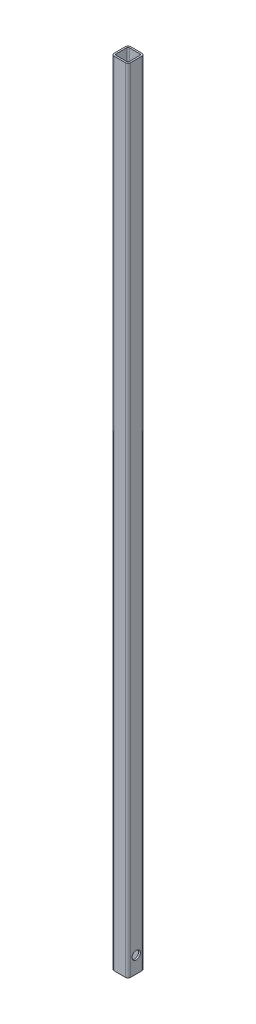
ISO-10303-21;
HEADER;
FILE_DESCRIPTION(('STEP AP214'),'2;1');
FILE_NAME('part.step','',(''),(''),'','','');
FILE_SCHEMA(('AUTOMOTIVE_DESIGN { 1 0 10303 214 1 1 1 1 }'));
ENDSEC;
DATA;
#1=APPLICATION_CONTEXT('core data for automotive mechanical design processes');
#2=APPLICATION_PROTOCOL_DEFINITION('international standard','automotive_design',2000,#1);
#3=PRODUCT_CONTEXT('',#1,'mechanical');
#4=PRODUCT('Part','Part','',(#3));
#5=PRODUCT_RELATED_PRODUCT_CATEGORY('part','',(#4));
#6=PRODUCT_DEFINITION_FORMATION('','',#4);
#7=PRODUCT_DEFINITION_CONTEXT('part definition',#1,'design');
#8=PRODUCT_DEFINITION('design','',#6,#7);
#9=PRODUCT_DEFINITION_SHAPE('','',#8);
#10=(LENGTH_UNIT() NAMED_UNIT(*) SI_UNIT(.MILLI.,.METRE.));
#11=(NAMED_UNIT(*) PLANE_ANGLE_UNIT() SI_UNIT($,.RADIAN.));
#12=(NAMED_UNIT(*) SI_UNIT($,.STERADIAN.) SOLID_ANGLE_UNIT());
#13=UNCERTAINTY_MEASURE_WITH_UNIT(LENGTH_MEASURE(1.E-05),#10,'distance_accuracy_value','');
#14=(GEOMETRIC_REPRESENTATION_CONTEXT(3) GLOBAL_UNCERTAINTY_ASSIGNED_CONTEXT((#13)) GLOBAL_UNIT_ASSIGNED_CONTEXT((#10,
#11,#12)) REPRESENTATION_CONTEXT('',''));
#15=CARTESIAN_POINT('',(0.,0.,0.));
#16=DIRECTION('',(0.,0.,1.));
#17=DIRECTION('',(1.,0.,0.));
#18=AXIS2_PLACEMENT_3D('',#15,#16,#17);
#19=CARTESIAN_POINT('',(4.,1219.2,-21.4));
#20=DIRECTION('',(0.,-1.,0.));
#21=DIRECTION('',(0.,0.,-1.));
#22=AXIS2_PLACEMENT_3D('',#19,#20,#21);
#23=PLANE('',#22);
#24=CARTESIAN_POINT('',(4.,1219.2,-21.4));
#25=DIRECTION('',(0.,1.,0.));
#26=DIRECTION('',(0.,0.,-1.));
#27=AXIS2_PLACEMENT_3D('',#24,#25,#26);
#28=CIRCLE('',#27,4.);
#29=CARTESIAN_POINT('',(4.00000000000003,1219.2,-25.4));
#30=VERTEX_POINT('',#29);
#31=CARTESIAN_POINT('',(0.,1219.2,-21.4));
#32=VERTEX_POINT('',#31);
#33=EDGE_CURVE('E213',#30,#32,#28,.T.);
#34=ORIENTED_EDGE('',*,*,#33,.T.);
#35=DIRECTION('',(0.,0.,1.));
#36=VECTOR('',#35,1.);
#37=CARTESIAN_POINT('',(0.,1219.2,-4.00000000000003));
#38=LINE('',#37,#36);
#39=CARTESIAN_POINT('',(0.,1219.2,-4.00000000000003));
#40=VERTEX_POINT('',#39);
#41=EDGE_CURVE('E216',#32,#40,#38,.T.);
#42=ORIENTED_EDGE('',*,*,#41,.T.);
#43=CARTESIAN_POINT('',(4.,1219.2,-4.));
#44=DIRECTION('',(0.,1.,0.));
#45=DIRECTION('',(0.,0.,-1.));
#46=AXIS2_PLACEMENT_3D('',#43,#44,#45);
#47=CIRCLE('',#46,4.);
#48=CARTESIAN_POINT('',(4.00000000000003,1219.2,0.));
#49=VERTEX_POINT('',#48);
#50=EDGE_CURVE('E219',#40,#49,#47,.T.);
#51=ORIENTED_EDGE('',*,*,#50,.T.);
#52=DIRECTION('',(1.,0.,0.));
#53=VECTOR('',#52,1.);
#54=CARTESIAN_POINT('',(4.00000000000003,1219.2,0.));
#55=LINE('',#54,#53);
#56=CARTESIAN_POINT('',(21.4,1219.2,0.));
#57=VERTEX_POINT('',#56);
#58=EDGE_CURVE('E221',#49,#57,#55,.T.);
#59=ORIENTED_EDGE('',*,*,#58,.T.);
#60=CARTESIAN_POINT('',(21.4,1219.2,-4.));
#61=DIRECTION('',(0.,1.,0.));
#62=DIRECTION('',(0.,0.,1.));
#63=AXIS2_PLACEMENT_3D('',#60,#61,#62);
#64=CIRCLE('',#63,4.);
#65=CARTESIAN_POINT('',(25.4,1219.2,-4.00000000000003));
#66=VERTEX_POINT('',#65);
#67=EDGE_CURVE('E223',#57,#66,#64,.T.);
#68=ORIENTED_EDGE('',*,*,#67,.T.);
#69=DIRECTION('',(0.,0.,-1.));
#70=VECTOR('',#69,1.);
#71=CARTESIAN_POINT('',(25.4,1219.2,-4.00000000000003));
#72=LINE('',#71,#70);
#73=CARTESIAN_POINT('',(25.4,1219.2,-21.4));
#74=VERTEX_POINT('',#73);
#75=EDGE_CURVE('E225',#66,#74,#72,.T.);
#76=ORIENTED_EDGE('',*,*,#75,.T.);
#77=CARTESIAN_POINT('',(21.4,1219.2,-21.4));
#78=DIRECTION('',(0.,1.,0.));
#79=DIRECTION('',(0.,0.,-1.));
#80=AXIS2_PLACEMENT_3D('',#77,#78,#79);
#81=CIRCLE('',#80,4.);
#82=CARTESIAN_POINT('',(21.4,1219.2,-25.4));
#83=VERTEX_POINT('',#82);
#84=EDGE_CURVE('E227',#74,#83,#81,.T.);
#85=ORIENTED_EDGE('',*,*,#84,.T.);
#86=DIRECTION('',(-1.,0.,0.));
#87=VECTOR('',#86,1.);
#88=CARTESIAN_POINT('',(4.00000000000003,1219.2,-25.4));
#89=LINE('',#88,#87);
#90=EDGE_CURVE('E229',#83,#30,#89,.T.);
#91=ORIENTED_EDGE('',*,*,#90,.T.);
#92=EDGE_LOOP('',(#34,#42,#51,#59,#68,#76,#85,#91));
#93=FACE_BOUND('',#92,.T.);
#94=CARTESIAN_POINT('',(4.54,1219.2,-20.86));
#95=DIRECTION('',(0.,1.,0.));
#96=DIRECTION('',(0.,0.,-1.));
#97=AXIS2_PLACEMENT_3D('',#94,#95,#96);
#98=CIRCLE('',#97,2.);
#99=CARTESIAN_POINT('',(4.54000000000002,1219.2,-22.86));
#100=VERTEX_POINT('',#99);
#101=CARTESIAN_POINT('',(2.54,1219.2,-20.86));
#102=VERTEX_POINT('',#101);
#103=EDGE_CURVE('E146',#100,#102,#98,.T.);
#104=ORIENTED_EDGE('',*,*,#103,.F.);
#105=DIRECTION('',(-1.,0.,0.));
#106=VECTOR('',#105,1.);
#107=CARTESIAN_POINT('',(20.86,1219.2,-22.86));
#108=LINE('',#107,#106);
#109=CARTESIAN_POINT('',(20.86,1219.2,-22.86));
#110=VERTEX_POINT('',#109);
#111=EDGE_CURVE('E180',#110,#100,#108,.T.);
#112=ORIENTED_EDGE('',*,*,#111,.F.);
#113=CARTESIAN_POINT('',(20.86,1219.2,-20.86));
#114=DIRECTION('',(0.,1.,0.));
#115=DIRECTION('',(0.,0.,1.));
#116=AXIS2_PLACEMENT_3D('',#113,#114,#115);
#117=CIRCLE('',#116,2.);
#118=CARTESIAN_POINT('',(22.86,1219.2,-20.86));
#119=VERTEX_POINT('',#118);
#120=EDGE_CURVE('E178',#119,#110,#117,.T.);
#121=ORIENTED_EDGE('',*,*,#120,.F.);
#122=DIRECTION('',(0.,0.,-1.));
#123=VECTOR('',#122,1.);
#124=CARTESIAN_POINT('',(22.86,1219.2,-4.54000000000001));
#125=LINE('',#124,#123);
#126=CARTESIAN_POINT('',(22.86,1219.2,-4.54000000000001));
#127=VERTEX_POINT('',#126);
#128=EDGE_CURVE('E176',#127,#119,#125,.T.);
#129=ORIENTED_EDGE('',*,*,#128,.F.);
#130=CARTESIAN_POINT('',(20.86,1219.2,-4.54));
#131=DIRECTION('',(0.,1.,0.));
#132=DIRECTION('',(0.,0.,-1.));
#133=AXIS2_PLACEMENT_3D('',#130,#131,#132);
#134=CIRCLE('',#133,2.);
#135=CARTESIAN_POINT('',(20.86,1219.2,-2.54));
#136=VERTEX_POINT('',#135);
#137=EDGE_CURVE('E174',#136,#127,#134,.T.);
#138=ORIENTED_EDGE('',*,*,#137,.F.);
#139=DIRECTION('',(1.,0.,0.));
#140=VECTOR('',#139,1.);
#141=CARTESIAN_POINT('',(20.86,1219.2,-2.54));
#142=LINE('',#141,#140);
#143=CARTESIAN_POINT('',(4.54000000000002,1219.2,-2.54));
#144=VERTEX_POINT('',#143);
#145=EDGE_CURVE('E169',#144,#136,#142,.T.);
#146=ORIENTED_EDGE('',*,*,#145,.F.);
#147=CARTESIAN_POINT('',(4.54,1219.2,-4.54));
#148=DIRECTION('',(0.,1.,0.));
#149=DIRECTION('',(0.,0.,-1.));
#150=AXIS2_PLACEMENT_3D('',#147,#148,#149);
#151=CIRCLE('',#150,2.);
#152=CARTESIAN_POINT('',(2.54,1219.2,-4.54000000000001));
#153=VERTEX_POINT('',#152);
#154=EDGE_CURVE('E167',#153,#144,#151,.T.);
#155=ORIENTED_EDGE('',*,*,#154,.F.);
#156=DIRECTION('',(0.,0.,1.));
#157=VECTOR('',#156,1.);
#158=CARTESIAN_POINT('',(2.54,1219.2,-4.54000000000001));
#159=LINE('',#158,#157);
#160=EDGE_CURVE('E154',#102,#153,#159,.T.);
#161=ORIENTED_EDGE('',*,*,#160,.F.);
#162=EDGE_LOOP('',(#104,#112,#121,#129,#138,#146,#155,#161));
#163=FACE_BOUND('',#162,.T.);
#164=ADVANCED_FACE('F32',(#93,#163),#23,.F.);
#165=CARTESIAN_POINT('',(4.,0.,-21.4));
#166=DIRECTION('',(0.,-1.,0.));
#167=DIRECTION('',(0.,0.,-1.));
#168=AXIS2_PLACEMENT_3D('',#165,#166,#167);
#169=PLANE('',#168);
#170=CARTESIAN_POINT('',(4.,0.,-21.4));
#171=DIRECTION('',(0.,1.,0.));
#172=DIRECTION('',(0.,0.,-1.));
#173=AXIS2_PLACEMENT_3D('',#170,#171,#172);
#174=CIRCLE('',#173,4.);
#175=CARTESIAN_POINT('',(4.00000000000003,0.,-25.4));
#176=VERTEX_POINT('',#175);
#177=CARTESIAN_POINT('',(0.,0.,-21.4));
#178=VERTEX_POINT('',#177);
#179=EDGE_CURVE('E162',#176,#178,#174,.T.);
#180=ORIENTED_EDGE('',*,*,#179,.F.);
#181=DIRECTION('',(-1.,0.,0.));
#182=VECTOR('',#181,1.);
#183=CARTESIAN_POINT('',(4.00000000000003,0.,-25.4));
#184=LINE('',#183,#182);
#185=CARTESIAN_POINT('',(21.4,0.,-25.4));
#186=VERTEX_POINT('',#185);
#187=EDGE_CURVE('E217',#186,#176,#184,.T.);
#188=ORIENTED_EDGE('',*,*,#187,.F.);
#189=CARTESIAN_POINT('',(21.4,0.,-21.4));
#190=DIRECTION('',(0.,1.,0.));
#191=DIRECTION('',(0.,0.,-1.));
#192=AXIS2_PLACEMENT_3D('',#189,#190,#191);
#193=CIRCLE('',#192,4.);
#194=CARTESIAN_POINT('',(25.4,0.,-21.4));
#195=VERTEX_POINT('',#194);
#196=EDGE_CURVE('E244',#195,#186,#193,.T.);
#197=ORIENTED_EDGE('',*,*,#196,.F.);
#198=DIRECTION('',(0.,0.,-1.));
#199=VECTOR('',#198,1.);
#200=CARTESIAN_POINT('',(25.4,0.,-4.00000000000003));
#201=LINE('',#200,#199);
#202=CARTESIAN_POINT('',(25.4,0.,-4.00000000000003));
#203=VERTEX_POINT('',#202);
#204=EDGE_CURVE('E242',#203,#195,#201,.T.);
#205=ORIENTED_EDGE('',*,*,#204,.F.);
#206=CARTESIAN_POINT('',(21.4,0.,-4.));
#207=DIRECTION('',(0.,1.,0.));
#208=DIRECTION('',(0.,0.,1.));
#209=AXIS2_PLACEMENT_3D('',#206,#207,#208);
#210=CIRCLE('',#209,4.);
#211=CARTESIAN_POINT('',(21.4,0.,0.));
#212=VERTEX_POINT('',#211);
#213=EDGE_CURVE('E240',#212,#203,#210,.T.);
#214=ORIENTED_EDGE('',*,*,#213,.F.);
#215=DIRECTION('',(1.,0.,0.));
#216=VECTOR('',#215,1.);
#217=CARTESIAN_POINT('',(4.00000000000003,0.,0.));
#218=LINE('',#217,#216);
#219=CARTESIAN_POINT('',(4.00000000000003,0.,0.));
#220=VERTEX_POINT('',#219);
#221=EDGE_CURVE('E238',#220,#212,#218,.T.);
#222=ORIENTED_EDGE('',*,*,#221,.F.);
#223=CARTESIAN_POINT('',(4.,0.,-4.));
#224=DIRECTION('',(0.,1.,0.));
#225=DIRECTION('',(0.,0.,-1.));
#226=AXIS2_PLACEMENT_3D('',#223,#224,#225);
#227=CIRCLE('',#226,4.);
#228=CARTESIAN_POINT('',(0.,0.,-4.00000000000003));
#229=VERTEX_POINT('',#228);
#230=EDGE_CURVE('E236',#229,#220,#227,.T.);
#231=ORIENTED_EDGE('',*,*,#230,.F.);
#232=DIRECTION('',(0.,0.,1.));
#233=VECTOR('',#232,1.);
#234=CARTESIAN_POINT('',(0.,0.,-4.00000000000003));
#235=LINE('',#234,#233);
#236=EDGE_CURVE('E234',#178,#229,#235,.T.);
#237=ORIENTED_EDGE('',*,*,#236,.F.);
#238=EDGE_LOOP('',(#180,#188,#197,#205,#214,#222,#231,#237));
#239=FACE_BOUND('',#238,.T.);
#240=DIRECTION('',(-1.,0.,0.));
#241=VECTOR('',#240,1.);
#242=CARTESIAN_POINT('',(20.86,0.,-22.86));
#243=LINE('',#242,#241);
#244=CARTESIAN_POINT('',(20.86,0.,-22.86));
#245=VERTEX_POINT('',#244);
#246=CARTESIAN_POINT('',(4.54000000000002,0.,-22.86));
#247=VERTEX_POINT('',#246);
#248=EDGE_CURVE('E155',#245,#247,#243,.T.);
#249=ORIENTED_EDGE('',*,*,#248,.T.);
#250=CARTESIAN_POINT('',(4.54,0.,-20.86));
#251=DIRECTION('',(0.,1.,0.));
#252=DIRECTION('',(0.,0.,-1.));
#253=AXIS2_PLACEMENT_3D('',#250,#251,#252);
#254=CIRCLE('',#253,2.);
#255=CARTESIAN_POINT('',(2.54,0.,-20.86));
#256=VERTEX_POINT('',#255);
#257=EDGE_CURVE('E56',#247,#256,#254,.T.);
#258=ORIENTED_EDGE('',*,*,#257,.T.);
#259=DIRECTION('',(0.,0.,1.));
#260=VECTOR('',#259,1.);
#261=CARTESIAN_POINT('',(2.54,0.,-4.54000000000001));
#262=LINE('',#261,#260);
#263=CARTESIAN_POINT('',(2.54,0.,-4.54000000000001));
#264=VERTEX_POINT('',#263);
#265=EDGE_CURVE('E161',#256,#264,#262,.T.);
#266=ORIENTED_EDGE('',*,*,#265,.T.);
#267=CARTESIAN_POINT('',(4.54,0.,-4.54));
#268=DIRECTION('',(0.,1.,0.));
#269=DIRECTION('',(0.,0.,-1.));
#270=AXIS2_PLACEMENT_3D('',#267,#268,#269);
#271=CIRCLE('',#270,2.);
#272=CARTESIAN_POINT('',(4.54000000000002,0.,-2.54));
#273=VERTEX_POINT('',#272);
#274=EDGE_CURVE('E185',#264,#273,#271,.T.);
#275=ORIENTED_EDGE('',*,*,#274,.T.);
#276=DIRECTION('',(1.,0.,0.));
#277=VECTOR('',#276,1.);
#278=CARTESIAN_POINT('',(20.86,0.,-2.54));
#279=LINE('',#278,#277);
#280=CARTESIAN_POINT('',(20.86,0.,-2.54));
#281=VERTEX_POINT('',#280);
#282=EDGE_CURVE('E188',#273,#281,#279,.T.);
#283=ORIENTED_EDGE('',*,*,#282,.T.);
#284=CARTESIAN_POINT('',(20.86,0.,-4.54));
#285=DIRECTION('',(0.,1.,0.));
#286=DIRECTION('',(0.,0.,-1.));
#287=AXIS2_PLACEMENT_3D('',#284,#285,#286);
#288=CIRCLE('',#287,2.);
#289=CARTESIAN_POINT('',(22.86,0.,-4.54000000000001));
#290=VERTEX_POINT('',#289);
#291=EDGE_CURVE('E191',#281,#290,#288,.T.);
#292=ORIENTED_EDGE('',*,*,#291,.T.);
#293=DIRECTION('',(0.,0.,-1.));
#294=VECTOR('',#293,1.);
#295=CARTESIAN_POINT('',(22.86,0.,-4.54000000000001));
#296=LINE('',#295,#294);
#297=CARTESIAN_POINT('',(22.86,0.,-20.86));
#298=VERTEX_POINT('',#297);
#299=EDGE_CURVE('E194',#290,#298,#296,.T.);
#300=ORIENTED_EDGE('',*,*,#299,.T.);
#301=CARTESIAN_POINT('',(20.86,0.,-20.86));
#302=DIRECTION('',(0.,1.,0.));
#303=DIRECTION('',(0.,0.,1.));
#304=AXIS2_PLACEMENT_3D('',#301,#302,#303);
#305=CIRCLE('',#304,2.);
#306=EDGE_CURVE('E197',#298,#245,#305,.T.);
#307=ORIENTED_EDGE('',*,*,#306,.T.);
#308=EDGE_LOOP('',(#249,#258,#266,#275,#283,#292,#300,#307));
#309=FACE_BOUND('',#308,.T.);
#310=ADVANCED_FACE('F275',(#239,#309),#169,.T.);
#311=CARTESIAN_POINT('',(4.,1219.2,-21.4));
#312=DIRECTION('',(0.,-1.,0.));
#313=DIRECTION('',(0.,0.,-1.));
#314=AXIS2_PLACEMENT_3D('',#311,#312,#313);
#315=CYLINDRICAL_SURFACE('',#314,4.);
#316=ORIENTED_EDGE('',*,*,#179,.T.);
#317=DIRECTION('',(0.,-1.,0.));
#318=VECTOR('',#317,1.);
#319=CARTESIAN_POINT('',(0.,1219.2,-21.4));
#320=LINE('',#319,#318);
#321=EDGE_CURVE('E11',#32,#178,#320,.T.);
#322=ORIENTED_EDGE('',*,*,#321,.F.);
#323=ORIENTED_EDGE('',*,*,#33,.F.);
#324=DIRECTION('',(0.,-1.,0.));
#325=VECTOR('',#324,1.);
#326=CARTESIAN_POINT('',(4.00000000000003,1219.2,-25.4));
#327=LINE('',#326,#325);
#328=EDGE_CURVE('E231',#30,#176,#327,.T.);
#329=ORIENTED_EDGE('',*,*,#328,.T.);
#330=EDGE_LOOP('',(#316,#322,#323,#329));
#331=FACE_BOUND('',#330,.T.);
#332=ADVANCED_FACE('F34',(#331),#315,.T.);
#333=CARTESIAN_POINT('',(0.,1219.2,-4.00000000000003));
#334=DIRECTION('',(1.,0.,0.));
#335=DIRECTION('',(0.,0.,-1.));
#336=AXIS2_PLACEMENT_3D('',#333,#334,#335);
#337=PLANE('',#336);
#338=CARTESIAN_POINT('',(0.,25.4,-12.7));
#339=DIRECTION('',(1.,0.,0.));
#340=DIRECTION('',(0.,0.,-1.));
#341=AXIS2_PLACEMENT_3D('',#338,#339,#340);
#342=CIRCLE('',#341,6.35);
#343=CARTESIAN_POINT('',(0.,25.4,-19.05));
#344=VERTEX_POINT('',#343);
#345=EDGE_CURVE('E373',#344,#344,#342,.T.);
#346=ORIENTED_EDGE('',*,*,#345,.T.);
#347=EDGE_LOOP('',(#346));
#348=FACE_BOUND('',#347,.T.);
#349=ORIENTED_EDGE('',*,*,#236,.T.);
#350=DIRECTION('',(0.,-1.,0.));
#351=VECTOR('',#350,1.);
#352=CARTESIAN_POINT('',(0.,1219.2,-4.00000000000003));
#353=LINE('',#352,#351);
#354=EDGE_CURVE('E41',#40,#229,#353,.T.);
#355=ORIENTED_EDGE('',*,*,#354,.F.);
#356=ORIENTED_EDGE('',*,*,#41,.F.);
#357=ORIENTED_EDGE('',*,*,#321,.T.);
#358=EDGE_LOOP('',(#349,#355,#356,#357));
#359=FACE_BOUND('',#358,.T.);
#360=ADVANCED_FACE('F292',(#348,#359),#337,.F.);
#361=CARTESIAN_POINT('',(4.,1219.2,-4.));
#362=DIRECTION('',(0.,-1.,0.));
#363=DIRECTION('',(0.,0.,-1.));
#364=AXIS2_PLACEMENT_3D('',#361,#362,#363);
#365=CYLINDRICAL_SURFACE('',#364,4.);
#366=ORIENTED_EDGE('',*,*,#230,.T.);
#367=DIRECTION('',(0.,-1.,0.));
#368=VECTOR('',#367,1.);
#369=CARTESIAN_POINT('',(4.00000000000003,1219.2,0.));
#370=LINE('',#369,#368);
#371=EDGE_CURVE('E261',#49,#220,#370,.T.);
#372=ORIENTED_EDGE('',*,*,#371,.F.);
#373=ORIENTED_EDGE('',*,*,#50,.F.);
#374=ORIENTED_EDGE('',*,*,#354,.T.);
#375=EDGE_LOOP('',(#366,#372,#373,#374));
#376=FACE_BOUND('',#375,.T.);
#377=ADVANCED_FACE('F269',(#376),#365,.T.);
#378=CARTESIAN_POINT('',(4.00000000000003,1219.2,0.));
#379=DIRECTION('',(0.,0.,-1.));
#380=DIRECTION('',(-1.,0.,0.));
#381=AXIS2_PLACEMENT_3D('',#378,#379,#380);
#382=PLANE('',#381);
#383=ORIENTED_EDGE('',*,*,#221,.T.);
#384=DIRECTION('',(0.,-1.,0.));
#385=VECTOR('',#384,1.);
#386=CARTESIAN_POINT('',(21.4,1219.2,0.));
#387=LINE('',#386,#385);
#388=EDGE_CURVE('E258',#57,#212,#387,.T.);
#389=ORIENTED_EDGE('',*,*,#388,.F.);
#390=ORIENTED_EDGE('',*,*,#58,.F.);
#391=ORIENTED_EDGE('',*,*,#371,.T.);
#392=EDGE_LOOP('',(#383,#389,#390,#391));
#393=FACE_BOUND('',#392,.T.);
#394=ADVANCED_FACE('F281',(#393),#382,.F.);
#395=CARTESIAN_POINT('',(21.4,1219.2,-4.));
#396=DIRECTION('',(0.,-1.,0.));
#397=DIRECTION('',(0.,0.,-1.));
#398=AXIS2_PLACEMENT_3D('',#395,#396,#397);
#399=CYLINDRICAL_SURFACE('',#398,4.);
#400=ORIENTED_EDGE('',*,*,#213,.T.);
#401=DIRECTION('',(0.,-1.,0.));
#402=VECTOR('',#401,1.);
#403=CARTESIAN_POINT('',(25.4,1219.2,-4.00000000000003));
#404=LINE('',#403,#402);
#405=EDGE_CURVE('E255',#66,#203,#404,.T.);
#406=ORIENTED_EDGE('',*,*,#405,.F.);
#407=ORIENTED_EDGE('',*,*,#67,.F.);
#408=ORIENTED_EDGE('',*,*,#388,.T.);
#409=EDGE_LOOP('',(#400,#406,#407,#408));
#410=FACE_BOUND('',#409,.T.);
#411=ADVANCED_FACE('F285',(#410),#399,.T.);
#412=CARTESIAN_POINT('',(25.4,1219.2,-4.00000000000003));
#413=DIRECTION('',(-1.,0.,0.));
#414=DIRECTION('',(0.,0.,1.));
#415=AXIS2_PLACEMENT_3D('',#412,#413,#414);
#416=PLANE('',#415);
#417=CARTESIAN_POINT('',(25.4,25.4,-12.7));
#418=DIRECTION('',(1.,0.,0.));
#419=DIRECTION('',(0.,0.,-1.));
#420=AXIS2_PLACEMENT_3D('',#417,#418,#419);
#421=CIRCLE('',#420,6.35);
#422=CARTESIAN_POINT('',(25.4,25.4,-19.05));
#423=VERTEX_POINT('',#422);
#424=EDGE_CURVE('E372',#423,#423,#421,.T.);
#425=ORIENTED_EDGE('',*,*,#424,.F.);
#426=EDGE_LOOP('',(#425));
#427=FACE_BOUND('',#426,.T.);
#428=ORIENTED_EDGE('',*,*,#204,.T.);
#429=DIRECTION('',(0.,-1.,0.));
#430=VECTOR('',#429,1.);
#431=CARTESIAN_POINT('',(25.4,1219.2,-21.4));
#432=LINE('',#431,#430);
#433=EDGE_CURVE('E252',#74,#195,#432,.T.);
#434=ORIENTED_EDGE('',*,*,#433,.F.);
#435=ORIENTED_EDGE('',*,*,#75,.F.);
#436=ORIENTED_EDGE('',*,*,#405,.T.);
#437=EDGE_LOOP('',(#428,#434,#435,#436));
#438=FACE_BOUND('',#437,.T.);
#439=ADVANCED_FACE('F305',(#427,#438),#416,.F.);
#440=CARTESIAN_POINT('',(21.4,1219.2,-21.4));
#441=DIRECTION('',(0.,-1.,0.));
#442=DIRECTION('',(0.,0.,-1.));
#443=AXIS2_PLACEMENT_3D('',#440,#441,#442);
#444=CYLINDRICAL_SURFACE('',#443,4.);
#445=ORIENTED_EDGE('',*,*,#196,.T.);
#446=DIRECTION('',(0.,-1.,0.));
#447=VECTOR('',#446,1.);
#448=CARTESIAN_POINT('',(21.4,1219.2,-25.4));
#449=LINE('',#448,#447);
#450=EDGE_CURVE('E249',#83,#186,#449,.T.);
#451=ORIENTED_EDGE('',*,*,#450,.F.);
#452=ORIENTED_EDGE('',*,*,#84,.F.);
#453=ORIENTED_EDGE('',*,*,#433,.T.);
#454=EDGE_LOOP('',(#445,#451,#452,#453));
#455=FACE_BOUND('',#454,.T.);
#456=ADVANCED_FACE('F303',(#455),#444,.T.);
#457=CARTESIAN_POINT('',(4.00000000000003,1219.2,-25.4));
#458=DIRECTION('',(0.,0.,1.));
#459=DIRECTION('',(1.,0.,0.));
#460=AXIS2_PLACEMENT_3D('',#457,#458,#459);
#461=PLANE('',#460);
#462=ORIENTED_EDGE('',*,*,#187,.T.);
#463=ORIENTED_EDGE('',*,*,#328,.F.);
#464=ORIENTED_EDGE('',*,*,#90,.F.);
#465=ORIENTED_EDGE('',*,*,#450,.T.);
#466=EDGE_LOOP('',(#462,#463,#464,#465));
#467=FACE_BOUND('',#466,.T.);
#468=ADVANCED_FACE('F298',(#467),#461,.F.);
#469=CARTESIAN_POINT('',(4.54,1219.2,-20.86));
#470=DIRECTION('',(0.,-1.,0.));
#471=DIRECTION('',(0.,0.,-1.));
#472=AXIS2_PLACEMENT_3D('',#469,#470,#471);
#473=CYLINDRICAL_SURFACE('',#472,2.);
#474=ORIENTED_EDGE('',*,*,#257,.F.);
#475=DIRECTION('',(0.,-1.,0.));
#476=VECTOR('',#475,1.);
#477=CARTESIAN_POINT('',(4.54000000000002,1219.2,-22.86));
#478=LINE('',#477,#476);
#479=EDGE_CURVE('E150',#100,#247,#478,.T.);
#480=ORIENTED_EDGE('',*,*,#479,.F.);
#481=ORIENTED_EDGE('',*,*,#103,.T.);
#482=DIRECTION('',(0.,-1.,0.));
#483=VECTOR('',#482,1.);
#484=CARTESIAN_POINT('',(2.54,1219.2,-20.86));
#485=LINE('',#484,#483);
#486=EDGE_CURVE('E149',#102,#256,#485,.T.);
#487=ORIENTED_EDGE('',*,*,#486,.T.);
#488=EDGE_LOOP('',(#474,#480,#481,#487));
#489=FACE_BOUND('',#488,.T.);
#490=ADVANCED_FACE('F148',(#489),#473,.F.);
#491=CARTESIAN_POINT('',(2.54,1219.2,-4.54000000000001));
#492=DIRECTION('',(1.,0.,0.));
#493=DIRECTION('',(0.,0.,-1.));
#494=AXIS2_PLACEMENT_3D('',#491,#492,#493);
#495=PLANE('',#494);
#496=CARTESIAN_POINT('',(2.54,25.4,-12.7));
#497=DIRECTION('',(1.,0.,0.));
#498=DIRECTION('',(0.,0.,-1.));
#499=AXIS2_PLACEMENT_3D('',#496,#497,#498);
#500=CIRCLE('',#499,6.35);
#501=CARTESIAN_POINT('',(2.54,25.4,-19.05));
#502=VERTEX_POINT('',#501);
#503=EDGE_CURVE('E183',#502,#502,#500,.T.);
#504=ORIENTED_EDGE('',*,*,#503,.F.);
#505=EDGE_LOOP('',(#504));
#506=FACE_BOUND('',#505,.T.);
#507=ORIENTED_EDGE('',*,*,#265,.F.);
#508=ORIENTED_EDGE('',*,*,#486,.F.);
#509=ORIENTED_EDGE('',*,*,#160,.T.);
#510=DIRECTION('',(0.,-1.,0.));
#511=VECTOR('',#510,1.);
#512=CARTESIAN_POINT('',(2.54,1219.2,-4.54000000000001));
#513=LINE('',#512,#511);
#514=EDGE_CURVE('E163',#153,#264,#513,.T.);
#515=ORIENTED_EDGE('',*,*,#514,.T.);
#516=EDGE_LOOP('',(#507,#508,#509,#515));
#517=FACE_BOUND('',#516,.T.);
#518=ADVANCED_FACE('F158',(#506,#517),#495,.T.);
#519=CARTESIAN_POINT('',(4.54,1219.2,-4.54));
#520=DIRECTION('',(0.,-1.,0.));
#521=DIRECTION('',(0.,0.,-1.));
#522=AXIS2_PLACEMENT_3D('',#519,#520,#521);
#523=CYLINDRICAL_SURFACE('',#522,2.);
#524=ORIENTED_EDGE('',*,*,#274,.F.);
#525=ORIENTED_EDGE('',*,*,#514,.F.);
#526=ORIENTED_EDGE('',*,*,#154,.T.);
#527=DIRECTION('',(0.,-1.,0.));
#528=VECTOR('',#527,1.);
#529=CARTESIAN_POINT('',(4.54000000000002,1219.2,-2.54));
#530=LINE('',#529,#528);
#531=EDGE_CURVE('E210',#144,#273,#530,.T.);
#532=ORIENTED_EDGE('',*,*,#531,.T.);
#533=EDGE_LOOP('',(#524,#525,#526,#532));
#534=FACE_BOUND('',#533,.T.);
#535=ADVANCED_FACE('F332',(#534),#523,.F.);
#536=CARTESIAN_POINT('',(20.86,1219.2,-2.54));
#537=DIRECTION('',(0.,0.,-1.));
#538=DIRECTION('',(-1.,0.,0.));
#539=AXIS2_PLACEMENT_3D('',#536,#537,#538);
#540=PLANE('',#539);
#541=ORIENTED_EDGE('',*,*,#282,.F.);
#542=ORIENTED_EDGE('',*,*,#531,.F.);
#543=ORIENTED_EDGE('',*,*,#145,.T.);
#544=DIRECTION('',(0.,-1.,0.));
#545=VECTOR('',#544,1.);
#546=CARTESIAN_POINT('',(20.86,1219.2,-2.54));
#547=LINE('',#546,#545);
#548=EDGE_CURVE('E208',#136,#281,#547,.T.);
#549=ORIENTED_EDGE('',*,*,#548,.T.);
#550=EDGE_LOOP('',(#541,#542,#543,#549));
#551=FACE_BOUND('',#550,.T.);
#552=ADVANCED_FACE('F337',(#551),#540,.T.);
#553=CARTESIAN_POINT('',(20.86,1219.2,-4.54));
#554=DIRECTION('',(0.,-1.,0.));
#555=DIRECTION('',(0.,0.,-1.));
#556=AXIS2_PLACEMENT_3D('',#553,#554,#555);
#557=CYLINDRICAL_SURFACE('',#556,2.);
#558=ORIENTED_EDGE('',*,*,#291,.F.);
#559=ORIENTED_EDGE('',*,*,#548,.F.);
#560=ORIENTED_EDGE('',*,*,#137,.T.);
#561=DIRECTION('',(0.,-1.,0.));
#562=VECTOR('',#561,1.);
#563=CARTESIAN_POINT('',(22.86,1219.2,-4.54000000000001));
#564=LINE('',#563,#562);
#565=EDGE_CURVE('E206',#127,#290,#564,.T.);
#566=ORIENTED_EDGE('',*,*,#565,.T.);
#567=EDGE_LOOP('',(#558,#559,#560,#566));
#568=FACE_BOUND('',#567,.T.);
#569=ADVANCED_FACE('F344',(#568),#557,.F.);
#570=CARTESIAN_POINT('',(22.86,1219.2,-4.54000000000001));
#571=DIRECTION('',(-1.,0.,0.));
#572=DIRECTION('',(0.,0.,1.));
#573=AXIS2_PLACEMENT_3D('',#570,#571,#572);
#574=PLANE('',#573);
#575=CARTESIAN_POINT('',(22.86,25.4,-12.7));
#576=DIRECTION('',(-1.,0.,0.));
#577=DIRECTION('',(0.,0.,1.));
#578=AXIS2_PLACEMENT_3D('',#575,#576,#577);
#579=CIRCLE('',#578,6.35);
#580=CARTESIAN_POINT('',(22.86,25.4,-6.35));
#581=VERTEX_POINT('',#580);
#582=EDGE_CURVE('E36',#581,#581,#579,.T.);
#583=ORIENTED_EDGE('',*,*,#582,.F.);
#584=EDGE_LOOP('',(#583));
#585=FACE_BOUND('',#584,.T.);
#586=ORIENTED_EDGE('',*,*,#299,.F.);
#587=ORIENTED_EDGE('',*,*,#565,.F.);
#588=ORIENTED_EDGE('',*,*,#128,.T.);
#589=DIRECTION('',(0.,-1.,0.));
#590=VECTOR('',#589,1.);
#591=CARTESIAN_POINT('',(22.86,1219.2,-20.86));
#592=LINE('',#591,#590);
#593=EDGE_CURVE('E204',#119,#298,#592,.T.);
#594=ORIENTED_EDGE('',*,*,#593,.T.);
#595=EDGE_LOOP('',(#586,#587,#588,#594));
#596=FACE_BOUND('',#595,.T.);
#597=ADVANCED_FACE('F348',(#585,#596),#574,.T.);
#598=CARTESIAN_POINT('',(20.86,1219.2,-20.86));
#599=DIRECTION('',(0.,-1.,0.));
#600=DIRECTION('',(0.,0.,-1.));
#601=AXIS2_PLACEMENT_3D('',#598,#599,#600);
#602=CYLINDRICAL_SURFACE('',#601,2.);
#603=ORIENTED_EDGE('',*,*,#306,.F.);
#604=ORIENTED_EDGE('',*,*,#593,.F.);
#605=ORIENTED_EDGE('',*,*,#120,.T.);
#606=DIRECTION('',(0.,-1.,0.));
#607=VECTOR('',#606,1.);
#608=CARTESIAN_POINT('',(20.86,1219.2,-22.86));
#609=LINE('',#608,#607);
#610=EDGE_CURVE('E48',#110,#245,#609,.T.);
#611=ORIENTED_EDGE('',*,*,#610,.T.);
#612=EDGE_LOOP('',(#603,#604,#605,#611));
#613=FACE_BOUND('',#612,.T.);
#614=ADVANCED_FACE('F352',(#613),#602,.F.);
#615=CARTESIAN_POINT('',(20.86,1219.2,-22.86));
#616=DIRECTION('',(0.,0.,1.));
#617=DIRECTION('',(1.,0.,0.));
#618=AXIS2_PLACEMENT_3D('',#615,#616,#617);
#619=PLANE('',#618);
#620=ORIENTED_EDGE('',*,*,#248,.F.);
#621=ORIENTED_EDGE('',*,*,#610,.F.);
#622=ORIENTED_EDGE('',*,*,#111,.T.);
#623=ORIENTED_EDGE('',*,*,#479,.T.);
#624=EDGE_LOOP('',(#620,#621,#622,#623));
#625=FACE_BOUND('',#624,.T.);
#626=ADVANCED_FACE('F356',(#625),#619,.T.);
#627=CARTESIAN_POINT('',(0.,25.4,-12.7));
#628=DIRECTION('',(1.,0.,0.));
#629=DIRECTION('',(0.,0.,-1.));
#630=AXIS2_PLACEMENT_3D('',#627,#628,#629);
#631=CYLINDRICAL_SURFACE('',#630,6.35);
#632=ORIENTED_EDGE('',*,*,#582,.T.);
#633=EDGE_LOOP('',(#632));
#634=FACE_BOUND('',#633,.T.);
#635=ORIENTED_EDGE('',*,*,#424,.T.);
#636=EDGE_LOOP('',(#635));
#637=FACE_BOUND('',#636,.T.);
#638=ADVANCED_FACE('F360',(#634,#637),#631,.F.);
#639=ORIENTED_EDGE('',*,*,#503,.T.);
#640=EDGE_LOOP('',(#639));
#641=FACE_BOUND('',#640,.T.);
#642=ORIENTED_EDGE('',*,*,#345,.F.);
#643=EDGE_LOOP('',(#642));
#644=FACE_BOUND('',#643,.T.);
#645=ADVANCED_FACE('F362',(#641,#644),#631,.F.);
#646=CLOSED_SHELL('',(#164,#310,#332,#360,#377,#394,#411,#439,#456,#468,#490,#518,#535,#552,
#569,#597,#614,#626,#638,#645));
#647=MANIFOLD_SOLID_BREP('B2',#646);
#648=ADVANCED_BREP_SHAPE_REPRESENTATION('',(#18,#647),#14);
#649=SHAPE_DEFINITION_REPRESENTATION(#9,#648);
ENDSEC;
END-ISO-10303-21;
